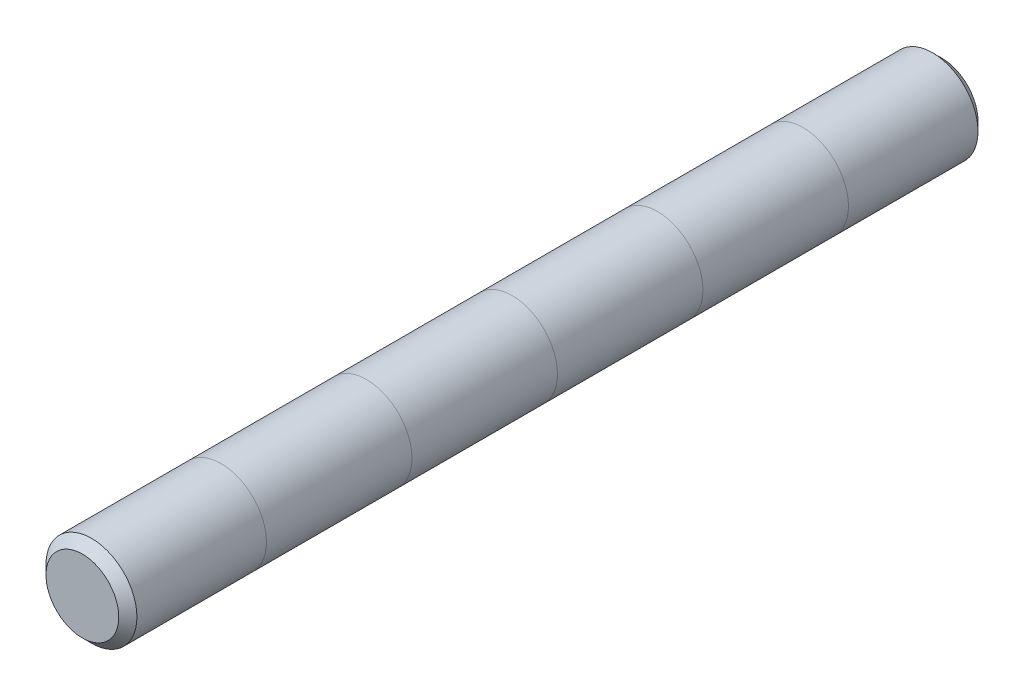
ISO-10303-21;
HEADER;
FILE_DESCRIPTION(('STEP AP214'),'2;1');
FILE_NAME('part.step','',(''),(''),'','','');
FILE_SCHEMA(('AUTOMOTIVE_DESIGN { 1 0 10303 214 1 1 1 1 }'));
ENDSEC;
DATA;
#1=APPLICATION_CONTEXT('core data for automotive mechanical design processes');
#2=APPLICATION_PROTOCOL_DEFINITION('international standard','automotive_design',2000,#1);
#3=PRODUCT_CONTEXT('',#1,'mechanical');
#4=PRODUCT('Part','Part','',(#3));
#5=PRODUCT_RELATED_PRODUCT_CATEGORY('part','',(#4));
#6=PRODUCT_DEFINITION_FORMATION('','',#4);
#7=PRODUCT_DEFINITION_CONTEXT('part definition',#1,'design');
#8=PRODUCT_DEFINITION('design','',#6,#7);
#9=PRODUCT_DEFINITION_SHAPE('','',#8);
#10=(LENGTH_UNIT() NAMED_UNIT(*) SI_UNIT(.MILLI.,.METRE.));
#11=(NAMED_UNIT(*) PLANE_ANGLE_UNIT() SI_UNIT($,.RADIAN.));
#12=(NAMED_UNIT(*) SI_UNIT($,.STERADIAN.) SOLID_ANGLE_UNIT());
#13=UNCERTAINTY_MEASURE_WITH_UNIT(LENGTH_MEASURE(1.E-05),#10,'distance_accuracy_value','');
#14=(GEOMETRIC_REPRESENTATION_CONTEXT(3) GLOBAL_UNCERTAINTY_ASSIGNED_CONTEXT((#13)) GLOBAL_UNIT_ASSIGNED_CONTEXT((#10,
#11,#12)) REPRESENTATION_CONTEXT('',''));
#15=CARTESIAN_POINT('',(0.,0.,0.));
#16=DIRECTION('',(0.,0.,1.));
#17=DIRECTION('',(1.,0.,0.));
#18=AXIS2_PLACEMENT_3D('',#15,#16,#17);
#19=CARTESIAN_POINT('',(0.,0.,75.));
#20=DIRECTION('',(0.,0.,-1.));
#21=DIRECTION('',(-1.,0.,0.));
#22=AXIS2_PLACEMENT_3D('',#19,#20,#21);
#23=CYLINDRICAL_SURFACE('',#22,7.9375);
#24=CARTESIAN_POINT('',(0.,0.,-25.4));
#25=DIRECTION('',(0.,0.,-1.));
#26=DIRECTION('',(0.,1.,0.));
#27=AXIS2_PLACEMENT_3D('',#24,#25,#26);
#28=CIRCLE('',#27,7.9375);
#29=CARTESIAN_POINT('',(0.,-7.9375,-25.4));
#30=VERTEX_POINT('',#29);
#31=CARTESIAN_POINT('',(0.,7.9375,-25.4));
#32=VERTEX_POINT('',#31);
#33=EDGE_CURVE('E117',#30,#32,#28,.T.);
#34=ORIENTED_EDGE('',*,*,#33,.T.);
#35=EDGE_CURVE('E120',#32,#30,#28,.T.);
#36=ORIENTED_EDGE('',*,*,#35,.T.);
#37=EDGE_LOOP('',(#34,#36));
#38=FACE_BOUND('',#37,.T.);
#39=CARTESIAN_POINT('',(0.,0.,-50.8));
#40=DIRECTION('',(0.,0.,-1.));
#41=DIRECTION('',(-1.,0.,0.));
#42=AXIS2_PLACEMENT_3D('',#39,#40,#41);
#43=CIRCLE('',#42,7.9375);
#44=CARTESIAN_POINT('',(0.,7.9375,-50.8));
#45=VERTEX_POINT('',#44);
#46=CARTESIAN_POINT('',(0.,-7.9375,-50.8));
#47=VERTEX_POINT('',#46);
#48=EDGE_CURVE('E11',#45,#47,#43,.T.);
#49=ORIENTED_EDGE('',*,*,#48,.F.);
#50=EDGE_CURVE('E52',#47,#45,#43,.T.);
#51=ORIENTED_EDGE('',*,*,#50,.F.);
#52=EDGE_LOOP('',(#49,#51));
#53=FACE_BOUND('',#52,.T.);
#54=ADVANCED_FACE('F48',(#38,#53),#23,.T.);
#55=CARTESIAN_POINT('',(0.,0.,0.));
#56=DIRECTION('',(0.,0.,-1.));
#57=DIRECTION('',(-1.,0.,0.));
#58=AXIS2_PLACEMENT_3D('',#55,#56,#57);
#59=CIRCLE('',#58,7.9375);
#60=CARTESIAN_POINT('',(0.,-7.9375,0.));
#61=VERTEX_POINT('',#60);
#62=CARTESIAN_POINT('',(0.,7.9375,0.));
#63=VERTEX_POINT('',#62);
#64=EDGE_CURVE('E97',#61,#63,#59,.T.);
#65=ORIENTED_EDGE('',*,*,#64,.T.);
#66=EDGE_CURVE('E112',#63,#61,#59,.T.);
#67=ORIENTED_EDGE('',*,*,#66,.T.);
#68=EDGE_LOOP('',(#65,#67));
#69=FACE_BOUND('',#68,.T.);
#70=ORIENTED_EDGE('',*,*,#35,.F.);
#71=ORIENTED_EDGE('',*,*,#33,.F.);
#72=EDGE_LOOP('',(#70,#71));
#73=FACE_BOUND('',#72,.T.);
#74=ADVANCED_FACE('F132',(#69,#73),#23,.T.);
#75=CARTESIAN_POINT('',(0.,0.,73.4125));
#76=DIRECTION('',(0.,0.,1.));
#77=DIRECTION('',(1.,0.,0.));
#78=AXIS2_PLACEMENT_3D('',#75,#76,#77);
#79=CIRCLE('',#78,7.9375);
#80=CARTESIAN_POINT('',(7.9375,0.,73.4125));
#81=VERTEX_POINT('',#80);
#82=EDGE_CURVE('E162',#81,#81,#79,.F.);
#83=ORIENTED_EDGE('',*,*,#82,.T.);
#84=EDGE_LOOP('',(#83));
#85=FACE_BOUND('',#84,.T.);
#86=CARTESIAN_POINT('',(0.,0.,50.8));
#87=DIRECTION('',(0.,0.,-1.));
#88=DIRECTION('',(-1.,0.,0.));
#89=AXIS2_PLACEMENT_3D('',#86,#87,#88);
#90=CIRCLE('',#89,7.9375);
#91=CARTESIAN_POINT('',(0.,7.9375,50.8));
#92=VERTEX_POINT('',#91);
#93=CARTESIAN_POINT('',(0.,-7.9375,50.8));
#94=VERTEX_POINT('',#93);
#95=EDGE_CURVE('E116',#92,#94,#90,.T.);
#96=ORIENTED_EDGE('',*,*,#95,.F.);
#97=EDGE_CURVE('E113',#94,#92,#90,.T.);
#98=ORIENTED_EDGE('',*,*,#97,.F.);
#99=EDGE_LOOP('',(#96,#98));
#100=FACE_BOUND('',#99,.T.);
#101=ADVANCED_FACE('F130',(#85,#100),#23,.T.);
#102=CARTESIAN_POINT('',(0.,0.,25.4));
#103=DIRECTION('',(0.,0.,-1.));
#104=DIRECTION('',(0.,1.,0.));
#105=AXIS2_PLACEMENT_3D('',#102,#103,#104);
#106=CIRCLE('',#105,7.9375);
#107=CARTESIAN_POINT('',(0.,-7.9375,25.4));
#108=VERTEX_POINT('',#107);
#109=CARTESIAN_POINT('',(0.,7.9375,25.4));
#110=VERTEX_POINT('',#109);
#111=EDGE_CURVE('E94',#108,#110,#106,.T.);
#112=ORIENTED_EDGE('',*,*,#111,.T.);
#113=EDGE_CURVE('E90',#110,#108,#106,.T.);
#114=ORIENTED_EDGE('',*,*,#113,.T.);
#115=EDGE_LOOP('',(#112,#114));
#116=FACE_BOUND('',#115,.T.);
#117=ORIENTED_EDGE('',*,*,#66,.F.);
#118=ORIENTED_EDGE('',*,*,#64,.F.);
#119=EDGE_LOOP('',(#117,#118));
#120=FACE_BOUND('',#119,.T.);
#121=ADVANCED_FACE('F92',(#116,#120),#23,.T.);
#122=ORIENTED_EDGE('',*,*,#97,.T.);
#123=ORIENTED_EDGE('',*,*,#95,.T.);
#124=EDGE_LOOP('',(#122,#123));
#125=FACE_BOUND('',#124,.T.);
#126=ORIENTED_EDGE('',*,*,#113,.F.);
#127=ORIENTED_EDGE('',*,*,#111,.F.);
#128=EDGE_LOOP('',(#126,#127));
#129=FACE_BOUND('',#128,.T.);
#130=ADVANCED_FACE('F99',(#125,#129),#23,.T.);
#131=ORIENTED_EDGE('',*,*,#50,.T.);
#132=ORIENTED_EDGE('',*,*,#48,.T.);
#133=EDGE_LOOP('',(#131,#132));
#134=FACE_BOUND('',#133,.T.);
#135=CARTESIAN_POINT('',(0.,0.,-73.4125));
#136=DIRECTION('',(0.,0.,1.));
#137=DIRECTION('',(1.,0.,0.));
#138=AXIS2_PLACEMENT_3D('',#135,#136,#137);
#139=CIRCLE('',#138,7.9375);
#140=CARTESIAN_POINT('',(7.9375,0.,-73.4125));
#141=VERTEX_POINT('',#140);
#142=EDGE_CURVE('E159',#141,#141,#139,.T.);
#143=ORIENTED_EDGE('',*,*,#142,.T.);
#144=EDGE_LOOP('',(#143));
#145=FACE_BOUND('',#144,.T.);
#146=ADVANCED_FACE('F141',(#134,#145),#23,.T.);
#147=CARTESIAN_POINT('',(0.,0.,75.));
#148=DIRECTION('',(0.,0.,1.));
#149=DIRECTION('',(1.,0.,0.));
#150=AXIS2_PLACEMENT_3D('',#147,#148,#149);
#151=PLANE('',#150);
#152=CARTESIAN_POINT('',(0.,0.,75.));
#153=DIRECTION('',(0.,0.,1.));
#154=DIRECTION('',(1.,0.,0.));
#155=AXIS2_PLACEMENT_3D('',#152,#153,#154);
#156=CIRCLE('',#155,6.34999999999997);
#157=CARTESIAN_POINT('',(6.34999999999997,0.,75.));
#158=VERTEX_POINT('',#157);
#159=EDGE_CURVE('E101',#158,#158,#156,.T.);
#160=ORIENTED_EDGE('',*,*,#159,.T.);
#161=EDGE_LOOP('',(#160));
#162=FACE_BOUND('',#161,.T.);
#163=ADVANCED_FACE('F148',(#162),#151,.T.);
#164=CARTESIAN_POINT('',(0.,0.,-75.));
#165=DIRECTION('',(0.,0.,1.));
#166=DIRECTION('',(1.,0.,0.));
#167=AXIS2_PLACEMENT_3D('',#164,#165,#166);
#168=PLANE('',#167);
#169=CARTESIAN_POINT('',(0.,0.,-75.));
#170=DIRECTION('',(0.,0.,1.));
#171=DIRECTION('',(1.,0.,0.));
#172=AXIS2_PLACEMENT_3D('',#169,#170,#171);
#173=CIRCLE('',#172,6.35000000000001);
#174=CARTESIAN_POINT('',(6.35000000000001,0.,-75.));
#175=VERTEX_POINT('',#174);
#176=EDGE_CURVE('E105',#175,#175,#173,.F.);
#177=ORIENTED_EDGE('',*,*,#176,.T.);
#178=EDGE_LOOP('',(#177));
#179=FACE_BOUND('',#178,.T.);
#180=ADVANCED_FACE('F153',(#179),#168,.F.);
#181=CARTESIAN_POINT('',(0.,0.,-73.4125));
#182=DIRECTION('',(0.,0.,1.));
#183=DIRECTION('',(1.,0.,0.));
#184=AXIS2_PLACEMENT_3D('',#181,#182,#183);
#185=CONICAL_SURFACE('',#184,7.9375,0.785398163397448);
#186=ORIENTED_EDGE('',*,*,#176,.F.);
#187=EDGE_LOOP('',(#186));
#188=FACE_BOUND('',#187,.T.);
#189=ORIENTED_EDGE('',*,*,#142,.F.);
#190=EDGE_LOOP('',(#189));
#191=FACE_BOUND('',#190,.T.);
#192=ADVANCED_FACE('F171',(#188,#191),#185,.T.);
#193=CARTESIAN_POINT('',(0.,0.,75.));
#194=DIRECTION('',(0.,0.,-1.));
#195=DIRECTION('',(-1.,0.,0.));
#196=AXIS2_PLACEMENT_3D('',#193,#194,#195);
#197=CONICAL_SURFACE('',#196,6.34999999999997,0.785398163397448);
#198=ORIENTED_EDGE('',*,*,#82,.F.);
#199=EDGE_LOOP('',(#198));
#200=FACE_BOUND('',#199,.T.);
#201=ORIENTED_EDGE('',*,*,#159,.F.);
#202=EDGE_LOOP('',(#201));
#203=FACE_BOUND('',#202,.T.);
#204=ADVANCED_FACE('F50',(#200,#203),#197,.T.);
#205=CLOSED_SHELL('',(#54,#74,#101,#121,#130,#146,#163,#180,#192,#204));
#206=MANIFOLD_SOLID_BREP('B2',#205);
#207=ADVANCED_BREP_SHAPE_REPRESENTATION('',(#18,#206),#14);
#208=SHAPE_DEFINITION_REPRESENTATION(#9,#207);
ENDSEC;
END-ISO-10303-21;
